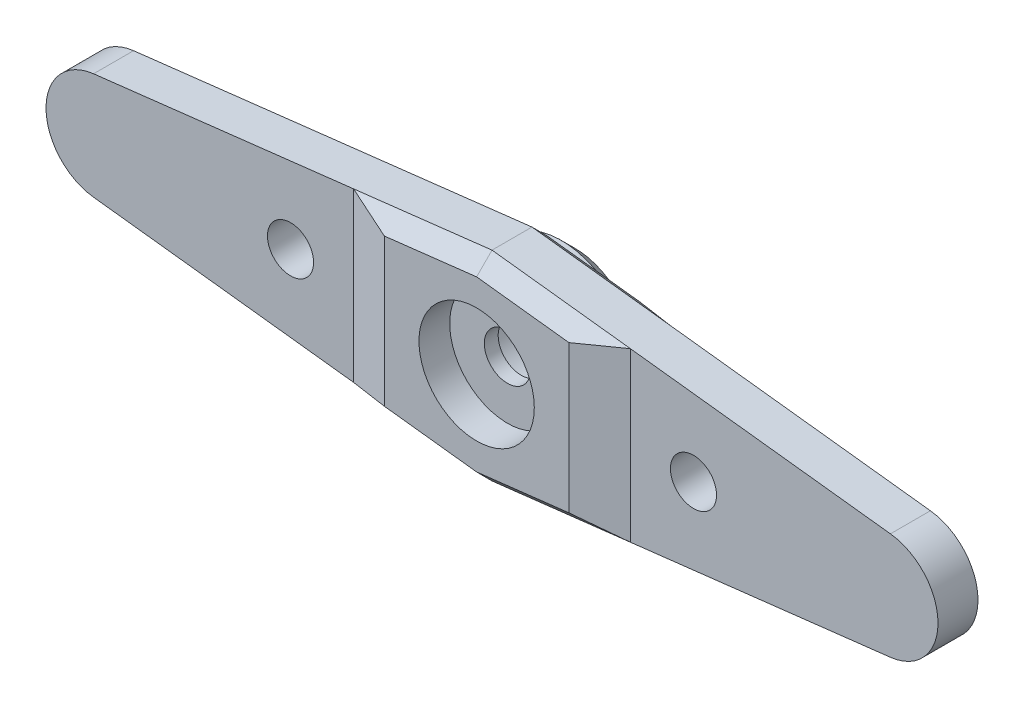
ISO-10303-21;
HEADER;
FILE_DESCRIPTION(('STEP AP214'),'2;1');
FILE_NAME('part.step','',(''),(''),'','','');
FILE_SCHEMA(('AUTOMOTIVE_DESIGN { 1 0 10303 214 1 1 1 1 }'));
ENDSEC;
DATA;
#1=APPLICATION_CONTEXT('core data for automotive mechanical design processes');
#2=APPLICATION_PROTOCOL_DEFINITION('international standard','automotive_design',2000,#1);
#3=PRODUCT_CONTEXT('',#1,'mechanical');
#4=PRODUCT('Part','Part','',(#3));
#5=PRODUCT_RELATED_PRODUCT_CATEGORY('part','',(#4));
#6=PRODUCT_DEFINITION_FORMATION('','',#4);
#7=PRODUCT_DEFINITION_CONTEXT('part definition',#1,'design');
#8=PRODUCT_DEFINITION('design','',#6,#7);
#9=PRODUCT_DEFINITION_SHAPE('','',#8);
#10=(LENGTH_UNIT() NAMED_UNIT(*) SI_UNIT(.MILLI.,.METRE.));
#11=(NAMED_UNIT(*) PLANE_ANGLE_UNIT() SI_UNIT($,.RADIAN.));
#12=(NAMED_UNIT(*) SI_UNIT($,.STERADIAN.) SOLID_ANGLE_UNIT());
#13=UNCERTAINTY_MEASURE_WITH_UNIT(LENGTH_MEASURE(1.E-05),#10,'distance_accuracy_value','');
#14=(GEOMETRIC_REPRESENTATION_CONTEXT(3) GLOBAL_UNCERTAINTY_ASSIGNED_CONTEXT((#13)) GLOBAL_UNIT_ASSIGNED_CONTEXT((#10,
#11,#12)) REPRESENTATION_CONTEXT('',''));
#15=CARTESIAN_POINT('',(0.,0.,0.));
#16=DIRECTION('',(0.,0.,1.));
#17=DIRECTION('',(1.,0.,0.));
#18=AXIS2_PLACEMENT_3D('',#15,#16,#17);
#19=CARTESIAN_POINT('',(0.,0.,-1.));
#20=DIRECTION('',(0.,0.,1.));
#21=DIRECTION('',(1.,0.,0.));
#22=AXIS2_PLACEMENT_3D('',#19,#20,#21);
#23=CYLINDRICAL_SURFACE('',#22,1.5);
#24=CARTESIAN_POINT('',(0.,0.,1.6));
#25=DIRECTION('',(0.,0.,1.));
#26=DIRECTION('',(1.,0.,0.));
#27=AXIS2_PLACEMENT_3D('',#24,#25,#26);
#28=CIRCLE('',#27,1.5);
#29=CARTESIAN_POINT('',(1.5,0.,1.6));
#30=VERTEX_POINT('',#29);
#31=EDGE_CURVE('E183',#30,#30,#28,.F.);
#32=ORIENTED_EDGE('',*,*,#31,.F.);
#33=EDGE_LOOP('',(#32));
#34=FACE_BOUND('',#33,.T.);
#35=CARTESIAN_POINT('',(0.,0.,0.699999999999999));
#36=DIRECTION('',(0.,0.,-1.));
#37=DIRECTION('',(-1.,0.,0.));
#38=AXIS2_PLACEMENT_3D('',#35,#36,#37);
#39=CIRCLE('',#38,1.5);
#40=CARTESIAN_POINT('',(-1.5,0.,0.699999999999999));
#41=VERTEX_POINT('',#40);
#42=EDGE_CURVE('E36',#41,#41,#39,.F.);
#43=ORIENTED_EDGE('',*,*,#42,.F.);
#44=EDGE_LOOP('',(#43));
#45=FACE_BOUND('',#44,.T.);
#46=ADVANCED_FACE('F32',(#34,#45),#23,.F.);
#47=CARTESIAN_POINT('',(25.5,0.,0.));
#48=DIRECTION('',(0.,0.,-1.));
#49=DIRECTION('',(-1.,0.,0.));
#50=AXIS2_PLACEMENT_3D('',#47,#48,#49);
#51=PLANE('',#50);
#52=DIRECTION('',(0.,1.,0.));
#53=VECTOR('',#52,1.);
#54=CARTESIAN_POINT('',(-9.,5.4495618893604,0.));
#55=LINE('',#54,#53);
#56=CARTESIAN_POINT('',(-9.,-5.4495618893604,0.));
#57=VERTEX_POINT('',#56);
#58=CARTESIAN_POINT('',(-9.,5.4495618893604,0.));
#59=VERTEX_POINT('',#58);
#60=EDGE_CURVE('E182',#57,#59,#55,.T.);
#61=ORIENTED_EDGE('',*,*,#60,.F.);
#62=DIRECTION('',(0.993257572769666,-0.115928400902071,0.));
#63=VECTOR('',#62,1.);
#64=CARTESIAN_POINT('',(0.,-6.5,0.));
#65=LINE('',#64,#63);
#66=CARTESIAN_POINT('',(-25.9057494031572,-3.47640150469385,0.));
#67=VERTEX_POINT('',#66);
#68=EDGE_CURVE('E178',#67,#57,#65,.T.);
#69=ORIENTED_EDGE('',*,*,#68,.F.);
#70=CARTESIAN_POINT('',(-25.5,0.,0.));
#71=DIRECTION('',(0.,0.,1.));
#72=DIRECTION('',(-1.,0.,0.));
#73=AXIS2_PLACEMENT_3D('',#70,#71,#72);
#74=CIRCLE('',#73,3.50000000000002);
#75=CARTESIAN_POINT('',(-25.9057494031572,3.47640150469384,0.));
#76=VERTEX_POINT('',#75);
#77=EDGE_CURVE('E232',#76,#67,#74,.T.);
#78=ORIENTED_EDGE('',*,*,#77,.F.);
#79=DIRECTION('',(-0.993257572769666,-0.115928400902071,0.));
#80=VECTOR('',#79,1.);
#81=CARTESIAN_POINT('',(-25.9057494031572,3.47640150469384,0.));
#82=LINE('',#81,#80);
#83=EDGE_CURVE('E206',#59,#76,#82,.T.);
#84=ORIENTED_EDGE('',*,*,#83,.F.);
#85=EDGE_LOOP('',(#61,#69,#78,#84));
#86=FACE_BOUND('',#85,.T.);
#87=CARTESIAN_POINT('',(-13.1,0.,0.));
#88=DIRECTION('',(0.,0.,1.));
#89=DIRECTION('',(1.,0.,0.));
#90=AXIS2_PLACEMENT_3D('',#87,#88,#89);
#91=CIRCLE('',#90,1.5);
#92=CARTESIAN_POINT('',(-11.6,0.,0.));
#93=VERTEX_POINT('',#92);
#94=EDGE_CURVE('E210',#93,#93,#91,.T.);
#95=ORIENTED_EDGE('',*,*,#94,.T.);
#96=EDGE_LOOP('',(#95));
#97=FACE_BOUND('',#96,.T.);
#98=ADVANCED_FACE('F380',(#86,#97),#51,.T.);
#99=CARTESIAN_POINT('',(25.5,0.,2.6));
#100=DIRECTION('',(0.,0.,-1.));
#101=DIRECTION('',(-1.,0.,0.));
#102=AXIS2_PLACEMENT_3D('',#99,#100,#101);
#103=PLANE('',#102);
#104=CARTESIAN_POINT('',(13.1,0.,2.6));
#105=DIRECTION('',(0.,0.,1.));
#106=DIRECTION('',(1.,0.,0.));
#107=AXIS2_PLACEMENT_3D('',#104,#105,#106);
#108=CIRCLE('',#107,1.5);
#109=CARTESIAN_POINT('',(14.6,0.,2.6));
#110=VERTEX_POINT('',#109);
#111=EDGE_CURVE('E207',#110,#110,#108,.T.);
#112=ORIENTED_EDGE('',*,*,#111,.F.);
#113=EDGE_LOOP('',(#112));
#114=FACE_BOUND('',#113,.T.);
#115=DIRECTION('',(0.,1.,0.));
#116=VECTOR('',#115,1.);
#117=CARTESIAN_POINT('',(9.,-5.4495618893604,2.6));
#118=LINE('',#117,#116);
#119=CARTESIAN_POINT('',(9.,-5.4495618893604,2.6));
#120=VERTEX_POINT('',#119);
#121=CARTESIAN_POINT('',(9.,5.4495618893604,2.6));
#122=VERTEX_POINT('',#121);
#123=EDGE_CURVE('E198',#120,#122,#118,.T.);
#124=ORIENTED_EDGE('',*,*,#123,.F.);
#125=DIRECTION('',(0.993257572769666,0.115928400902072,0.));
#126=VECTOR('',#125,1.);
#127=CARTESIAN_POINT('',(25.9057494031572,-3.47640150469383,2.6));
#128=LINE('',#127,#126);
#129=CARTESIAN_POINT('',(25.9057494031573,-3.47640150469383,2.6));
#130=VERTEX_POINT('',#129);
#131=EDGE_CURVE('E223',#120,#130,#128,.T.);
#132=ORIENTED_EDGE('',*,*,#131,.T.);
#133=CARTESIAN_POINT('',(25.5,0.,2.6));
#134=DIRECTION('',(0.,0.,1.));
#135=DIRECTION('',(-1.,0.,0.));
#136=AXIS2_PLACEMENT_3D('',#133,#134,#135);
#137=CIRCLE('',#136,3.5);
#138=CARTESIAN_POINT('',(25.9057494031572,3.47640150469383,2.6));
#139=VERTEX_POINT('',#138);
#140=EDGE_CURVE('E225',#130,#139,#137,.T.);
#141=ORIENTED_EDGE('',*,*,#140,.T.);
#142=DIRECTION('',(-0.993257572769666,0.115928400902072,0.));
#143=VECTOR('',#142,1.);
#144=CARTESIAN_POINT('',(0.,6.5,2.6));
#145=LINE('',#144,#143);
#146=EDGE_CURVE('E227',#139,#122,#145,.T.);
#147=ORIENTED_EDGE('',*,*,#146,.T.);
#148=EDGE_LOOP('',(#124,#132,#141,#147));
#149=FACE_BOUND('',#148,.T.);
#150=ADVANCED_FACE('F359',(#114,#149),#103,.F.);
#151=CARTESIAN_POINT('',(-13.1,0.,2.6));
#152=DIRECTION('',(0.,0.,1.));
#153=DIRECTION('',(1.,0.,0.));
#154=AXIS2_PLACEMENT_3D('',#151,#152,#153);
#155=CIRCLE('',#154,1.5);
#156=CARTESIAN_POINT('',(-11.6,0.,2.6));
#157=VERTEX_POINT('',#156);
#158=EDGE_CURVE('E202',#157,#157,#155,.T.);
#159=ORIENTED_EDGE('',*,*,#158,.F.);
#160=EDGE_LOOP('',(#159));
#161=FACE_BOUND('',#160,.T.);
#162=DIRECTION('',(0.,-1.,0.));
#163=VECTOR('',#162,1.);
#164=CARTESIAN_POINT('',(-9.,5.4495618893604,2.6));
#165=LINE('',#164,#163);
#166=CARTESIAN_POINT('',(-9.,5.4495618893604,2.6));
#167=VERTEX_POINT('',#166);
#168=CARTESIAN_POINT('',(-9.,-5.44956188936041,2.6));
#169=VERTEX_POINT('',#168);
#170=EDGE_CURVE('E195',#167,#169,#165,.T.);
#171=ORIENTED_EDGE('',*,*,#170,.F.);
#172=DIRECTION('',(-0.993257572769666,-0.115928400902071,0.));
#173=VECTOR('',#172,1.);
#174=CARTESIAN_POINT('',(-25.9057494031572,3.47640150469384,2.6));
#175=LINE('',#174,#173);
#176=CARTESIAN_POINT('',(-25.9057494031572,3.47640150469384,2.6));
#177=VERTEX_POINT('',#176);
#178=EDGE_CURVE('E215',#167,#177,#175,.T.);
#179=ORIENTED_EDGE('',*,*,#178,.T.);
#180=CARTESIAN_POINT('',(-25.5,0.,2.6));
#181=DIRECTION('',(0.,0.,1.));
#182=DIRECTION('',(-1.,0.,0.));
#183=AXIS2_PLACEMENT_3D('',#180,#181,#182);
#184=CIRCLE('',#183,3.50000000000002);
#185=CARTESIAN_POINT('',(-25.9057494031572,-3.47640150469385,2.6));
#186=VERTEX_POINT('',#185);
#187=EDGE_CURVE('E217',#177,#186,#184,.T.);
#188=ORIENTED_EDGE('',*,*,#187,.T.);
#189=DIRECTION('',(0.993257572769666,-0.115928400902071,0.));
#190=VECTOR('',#189,1.);
#191=CARTESIAN_POINT('',(0.,-6.5,2.6));
#192=LINE('',#191,#190);
#193=EDGE_CURVE('E220',#186,#169,#192,.T.);
#194=ORIENTED_EDGE('',*,*,#193,.T.);
#195=EDGE_LOOP('',(#171,#179,#188,#194));
#196=FACE_BOUND('',#195,.T.);
#197=ADVANCED_FACE('F443',(#161,#196),#103,.F.);
#198=CARTESIAN_POINT('',(-25.9057494031572,3.47640150469384,2.6));
#199=DIRECTION('',(0.115928400902071,-0.993257572769666,0.));
#200=DIRECTION('',(0.993257572769666,0.115928400902071,0.));
#201=AXIS2_PLACEMENT_3D('',#198,#199,#200);
#202=PLANE('',#201);
#203=DIRECTION('',(0.,0.,-1.));
#204=VECTOR('',#203,1.);
#205=CARTESIAN_POINT('',(0.,6.5,2.6));
#206=LINE('',#205,#204);
#207=CARTESIAN_POINT('',(0.,6.5,2.59999999999999));
#208=VERTEX_POINT('',#207);
#209=CARTESIAN_POINT('',(0.,6.5,0.));
#210=VERTEX_POINT('',#209);
#211=EDGE_CURVE('E230',#208,#210,#206,.T.);
#212=ORIENTED_EDGE('',*,*,#211,.T.);
#213=DIRECTION('',(-0.993257572769666,-0.115928400902071,0.));
#214=VECTOR('',#213,1.);
#215=CARTESIAN_POINT('',(-25.9057494031572,3.47640150469384,0.));
#216=LINE('',#215,#214);
#217=EDGE_CURVE('E298',#210,#59,#216,.T.);
#218=ORIENTED_EDGE('',*,*,#217,.T.);
#219=ORIENTED_EDGE('',*,*,#83,.T.);
#220=DIRECTION('',(0.,0.,-1.));
#221=VECTOR('',#220,1.);
#222=CARTESIAN_POINT('',(-25.9057494031572,3.47640150469384,2.6));
#223=LINE('',#222,#221);
#224=EDGE_CURVE('E249',#177,#76,#223,.T.);
#225=ORIENTED_EDGE('',*,*,#224,.F.);
#226=ORIENTED_EDGE('',*,*,#178,.F.);
#227=DIRECTION('',(0.993257572769666,0.115928400902071,0.));
#228=VECTOR('',#227,1.);
#229=CARTESIAN_POINT('',(0.,6.5,2.59999999999999));
#230=LINE('',#229,#228);
#231=EDGE_CURVE('E267',#167,#208,#230,.T.);
#232=ORIENTED_EDGE('',*,*,#231,.T.);
#233=EDGE_LOOP('',(#212,#218,#219,#225,#226,#232));
#234=FACE_BOUND('',#233,.T.);
#235=ADVANCED_FACE('F376',(#234),#202,.F.);
#236=CARTESIAN_POINT('',(-25.5,0.,2.6));
#237=DIRECTION('',(0.,0.,-1.));
#238=DIRECTION('',(-1.,0.,0.));
#239=AXIS2_PLACEMENT_3D('',#236,#237,#238);
#240=CYLINDRICAL_SURFACE('',#239,3.50000000000002);
#241=ORIENTED_EDGE('',*,*,#77,.T.);
#242=DIRECTION('',(0.,0.,-1.));
#243=VECTOR('',#242,1.);
#244=CARTESIAN_POINT('',(-25.9057494031572,-3.47640150469385,2.6));
#245=LINE('',#244,#243);
#246=EDGE_CURVE('E246',#186,#67,#245,.T.);
#247=ORIENTED_EDGE('',*,*,#246,.F.);
#248=ORIENTED_EDGE('',*,*,#187,.F.);
#249=ORIENTED_EDGE('',*,*,#224,.T.);
#250=EDGE_LOOP('',(#241,#247,#248,#249));
#251=FACE_BOUND('',#250,.T.);
#252=ADVANCED_FACE('F396',(#251),#240,.T.);
#253=CARTESIAN_POINT('',(0.,-6.5,2.6));
#254=DIRECTION('',(0.115928400902071,0.993257572769666,0.));
#255=DIRECTION('',(-0.993257572769666,0.115928400902071,0.));
#256=AXIS2_PLACEMENT_3D('',#253,#254,#255);
#257=PLANE('',#256);
#258=ORIENTED_EDGE('',*,*,#68,.T.);
#259=DIRECTION('',(0.993257572769666,-0.115928400902071,0.));
#260=VECTOR('',#259,1.);
#261=CARTESIAN_POINT('',(0.,-6.5,0.));
#262=LINE('',#261,#260);
#263=CARTESIAN_POINT('',(0.,-6.5,0.));
#264=VERTEX_POINT('',#263);
#265=EDGE_CURVE('E167',#57,#264,#262,.T.);
#266=ORIENTED_EDGE('',*,*,#265,.T.);
#267=DIRECTION('',(0.,0.,-1.));
#268=VECTOR('',#267,1.);
#269=CARTESIAN_POINT('',(0.,-6.5,2.6));
#270=LINE('',#269,#268);
#271=CARTESIAN_POINT('',(0.,-6.5,2.6));
#272=VERTEX_POINT('',#271);
#273=EDGE_CURVE('E166',#272,#264,#270,.T.);
#274=ORIENTED_EDGE('',*,*,#273,.F.);
#275=DIRECTION('',(-0.993257572769666,0.115928400902071,0.));
#276=VECTOR('',#275,1.);
#277=CARTESIAN_POINT('',(-9.,-5.4495618893604,2.6));
#278=LINE('',#277,#276);
#279=EDGE_CURVE('E264',#272,#169,#278,.T.);
#280=ORIENTED_EDGE('',*,*,#279,.T.);
#281=ORIENTED_EDGE('',*,*,#193,.F.);
#282=ORIENTED_EDGE('',*,*,#246,.T.);
#283=EDGE_LOOP('',(#258,#266,#274,#280,#281,#282));
#284=FACE_BOUND('',#283,.T.);
#285=ADVANCED_FACE('F390',(#284),#257,.F.);
#286=CARTESIAN_POINT('',(25.9057494031572,-3.47640150469383,2.6));
#287=DIRECTION('',(-0.115928400902072,0.993257572769666,0.));
#288=DIRECTION('',(-0.993257572769666,-0.115928400902072,0.));
#289=AXIS2_PLACEMENT_3D('',#286,#287,#288);
#290=PLANE('',#289);
#291=ORIENTED_EDGE('',*,*,#273,.T.);
#292=DIRECTION('',(0.993257572769666,0.115928400902072,0.));
#293=VECTOR('',#292,1.);
#294=CARTESIAN_POINT('',(25.9057494031572,-3.47640150469383,0.));
#295=LINE('',#294,#293);
#296=CARTESIAN_POINT('',(9.,-5.4495618893604,0.));
#297=VERTEX_POINT('',#296);
#298=EDGE_CURVE('E152',#264,#297,#295,.T.);
#299=ORIENTED_EDGE('',*,*,#298,.T.);
#300=DIRECTION('',(0.993257572769666,0.115928400902072,0.));
#301=VECTOR('',#300,1.);
#302=CARTESIAN_POINT('',(25.9057494031572,-3.47640150469383,0.));
#303=LINE('',#302,#301);
#304=CARTESIAN_POINT('',(25.9057494031573,-3.47640150469383,0.));
#305=VERTEX_POINT('',#304);
#306=EDGE_CURVE('E163',#297,#305,#303,.T.);
#307=ORIENTED_EDGE('',*,*,#306,.T.);
#308=DIRECTION('',(0.,0.,-1.));
#309=VECTOR('',#308,1.);
#310=CARTESIAN_POINT('',(25.9057494031573,-3.47640150469383,2.6));
#311=LINE('',#310,#309);
#312=EDGE_CURVE('E243',#130,#305,#311,.T.);
#313=ORIENTED_EDGE('',*,*,#312,.F.);
#314=ORIENTED_EDGE('',*,*,#131,.F.);
#315=DIRECTION('',(-0.993257572769666,-0.115928400902072,0.));
#316=VECTOR('',#315,1.);
#317=CARTESIAN_POINT('',(0.,-6.5,2.6));
#318=LINE('',#317,#316);
#319=EDGE_CURVE('E262',#120,#272,#318,.T.);
#320=ORIENTED_EDGE('',*,*,#319,.T.);
#321=EDGE_LOOP('',(#291,#299,#307,#313,#314,#320));
#322=FACE_BOUND('',#321,.T.);
#323=ADVANCED_FACE('F161',(#322),#290,.F.);
#324=CARTESIAN_POINT('',(25.5,0.,2.6));
#325=DIRECTION('',(0.,0.,-1.));
#326=DIRECTION('',(-1.,0.,0.));
#327=AXIS2_PLACEMENT_3D('',#324,#325,#326);
#328=CYLINDRICAL_SURFACE('',#327,3.5);
#329=CARTESIAN_POINT('',(25.5,0.,0.));
#330=DIRECTION('',(0.,0.,1.));
#331=DIRECTION('',(-1.,0.,0.));
#332=AXIS2_PLACEMENT_3D('',#329,#330,#331);
#333=CIRCLE('',#332,3.5);
#334=CARTESIAN_POINT('',(25.9057494031572,3.47640150469383,0.));
#335=VERTEX_POINT('',#334);
#336=EDGE_CURVE('E177',#305,#335,#333,.T.);
#337=ORIENTED_EDGE('',*,*,#336,.T.);
#338=DIRECTION('',(0.,0.,-1.));
#339=VECTOR('',#338,1.);
#340=CARTESIAN_POINT('',(25.9057494031572,3.47640150469383,2.6));
#341=LINE('',#340,#339);
#342=EDGE_CURVE('E240',#139,#335,#341,.T.);
#343=ORIENTED_EDGE('',*,*,#342,.F.);
#344=ORIENTED_EDGE('',*,*,#140,.F.);
#345=ORIENTED_EDGE('',*,*,#312,.T.);
#346=EDGE_LOOP('',(#337,#343,#344,#345));
#347=FACE_BOUND('',#346,.T.);
#348=ADVANCED_FACE('F364',(#347),#328,.T.);
#349=CARTESIAN_POINT('',(0.,6.5,2.6));
#350=DIRECTION('',(-0.115928400902072,-0.993257572769666,0.));
#351=DIRECTION('',(0.993257572769666,-0.115928400902072,0.));
#352=AXIS2_PLACEMENT_3D('',#349,#350,#351);
#353=PLANE('',#352);
#354=DIRECTION('',(-0.993257572769666,0.115928400902072,0.));
#355=VECTOR('',#354,1.);
#356=CARTESIAN_POINT('',(0.,6.5,0.));
#357=LINE('',#356,#355);
#358=CARTESIAN_POINT('',(9.,5.4495618893604,0.));
#359=VERTEX_POINT('',#358);
#360=EDGE_CURVE('E218',#335,#359,#357,.T.);
#361=ORIENTED_EDGE('',*,*,#360,.T.);
#362=DIRECTION('',(-0.993257572769666,0.115928400902072,0.));
#363=VECTOR('',#362,1.);
#364=CARTESIAN_POINT('',(0.,6.5,0.));
#365=LINE('',#364,#363);
#366=EDGE_CURVE('E168',#359,#210,#365,.T.);
#367=ORIENTED_EDGE('',*,*,#366,.T.);
#368=ORIENTED_EDGE('',*,*,#211,.F.);
#369=DIRECTION('',(0.993257572769666,-0.115928400902072,0.));
#370=VECTOR('',#369,1.);
#371=CARTESIAN_POINT('',(9.,5.4495618893604,2.59999999999999));
#372=LINE('',#371,#370);
#373=EDGE_CURVE('E269',#208,#122,#372,.T.);
#374=ORIENTED_EDGE('',*,*,#373,.T.);
#375=ORIENTED_EDGE('',*,*,#146,.F.);
#376=ORIENTED_EDGE('',*,*,#342,.T.);
#377=EDGE_LOOP('',(#361,#367,#368,#374,#375,#376));
#378=FACE_BOUND('',#377,.T.);
#379=ADVANCED_FACE('F357',(#378),#353,.F.);
#380=DIRECTION('',(0.,-1.,0.));
#381=VECTOR('',#380,1.);
#382=CARTESIAN_POINT('',(9.,-5.4495618893604,0.));
#383=LINE('',#382,#381);
#384=EDGE_CURVE('E175',#359,#297,#383,.T.);
#385=ORIENTED_EDGE('',*,*,#384,.F.);
#386=ORIENTED_EDGE('',*,*,#360,.F.);
#387=ORIENTED_EDGE('',*,*,#336,.F.);
#388=ORIENTED_EDGE('',*,*,#306,.F.);
#389=EDGE_LOOP('',(#385,#386,#387,#388));
#390=FACE_BOUND('',#389,.T.);
#391=CARTESIAN_POINT('',(13.1,0.,0.));
#392=DIRECTION('',(0.,0.,1.));
#393=DIRECTION('',(1.,0.,0.));
#394=AXIS2_PLACEMENT_3D('',#391,#392,#393);
#395=CIRCLE('',#394,1.5);
#396=CARTESIAN_POINT('',(14.6,0.,0.));
#397=VERTEX_POINT('',#396);
#398=EDGE_CURVE('E203',#397,#397,#395,.T.);
#399=ORIENTED_EDGE('',*,*,#398,.T.);
#400=EDGE_LOOP('',(#399));
#401=FACE_BOUND('',#400,.T.);
#402=ADVANCED_FACE('F172',(#390,#401),#51,.T.);
#403=CARTESIAN_POINT('',(-13.1,0.,0.));
#404=DIRECTION('',(0.,0.,1.));
#405=DIRECTION('',(1.,0.,0.));
#406=AXIS2_PLACEMENT_3D('',#403,#404,#405);
#407=CYLINDRICAL_SURFACE('',#406,1.5);
#408=ORIENTED_EDGE('',*,*,#94,.F.);
#409=EDGE_LOOP('',(#408));
#410=FACE_BOUND('',#409,.T.);
#411=ORIENTED_EDGE('',*,*,#158,.T.);
#412=EDGE_LOOP('',(#411));
#413=FACE_BOUND('',#412,.T.);
#414=ADVANCED_FACE('F437',(#410,#413),#407,.F.);
#415=CARTESIAN_POINT('',(13.1,0.,0.));
#416=DIRECTION('',(0.,0.,1.));
#417=DIRECTION('',(1.,0.,0.));
#418=AXIS2_PLACEMENT_3D('',#415,#416,#417);
#419=CYLINDRICAL_SURFACE('',#418,1.5);
#420=ORIENTED_EDGE('',*,*,#398,.F.);
#421=EDGE_LOOP('',(#420));
#422=FACE_BOUND('',#421,.T.);
#423=ORIENTED_EDGE('',*,*,#111,.T.);
#424=EDGE_LOOP('',(#423));
#425=FACE_BOUND('',#424,.T.);
#426=ADVANCED_FACE('F339',(#422,#425),#419,.F.);
#427=CARTESIAN_POINT('',(0.,0.,3.6));
#428=DIRECTION('',(0.,0.,1.));
#429=DIRECTION('',(1.,0.,0.));
#430=AXIS2_PLACEMENT_3D('',#427,#428,#429);
#431=PLANE('',#430);
#432=CARTESIAN_POINT('',(0.,0.,3.6));
#433=DIRECTION('',(0.,0.,1.));
#434=DIRECTION('',(1.,0.,0.));
#435=AXIS2_PLACEMENT_3D('',#432,#433,#434);
#436=CIRCLE('',#435,3.75);
#437=CARTESIAN_POINT('',(3.75,0.,3.6));
#438=VERTEX_POINT('',#437);
#439=EDGE_CURVE('E192',#438,#438,#436,.T.);
#440=ORIENTED_EDGE('',*,*,#439,.F.);
#441=EDGE_LOOP('',(#440));
#442=FACE_BOUND('',#441,.T.);
#443=DIRECTION('',(0.993257572769666,0.115928400902072,0.));
#444=VECTOR('',#443,1.);
#445=CARTESIAN_POINT('',(8.88407159909793,-4.45630431659073,3.6));
#446=LINE('',#445,#444);
#447=CARTESIAN_POINT('',(0.,-5.49321180385111,3.6));
#448=VERTEX_POINT('',#447);
#449=CARTESIAN_POINT('',(5.99999999999998,-4.79291973009138,3.6));
#450=VERTEX_POINT('',#449);
#451=EDGE_CURVE('E259',#448,#450,#446,.T.);
#452=ORIENTED_EDGE('',*,*,#451,.T.);
#453=DIRECTION('',(0.,1.,0.));
#454=VECTOR('',#453,1.);
#455=CARTESIAN_POINT('',(5.99999999999998,4.4427736932115,3.6));
#456=LINE('',#455,#454);
#457=CARTESIAN_POINT('',(5.99999999999998,4.79291973009137,3.6));
#458=VERTEX_POINT('',#457);
#459=EDGE_CURVE('E279',#450,#458,#456,.T.);
#460=ORIENTED_EDGE('',*,*,#459,.T.);
#461=DIRECTION('',(-0.993257572769666,0.115928400902072,0.));
#462=VECTOR('',#461,1.);
#463=CARTESIAN_POINT('',(-0.115928400902071,5.50674242723033,3.6));
#464=LINE('',#463,#462);
#465=CARTESIAN_POINT('',(0.,5.4932118038511,3.6));
#466=VERTEX_POINT('',#465);
#467=EDGE_CURVE('E252',#458,#466,#464,.T.);
#468=ORIENTED_EDGE('',*,*,#467,.T.);
#469=DIRECTION('',(-0.993257572769666,-0.115928400902071,0.));
#470=VECTOR('',#469,1.);
#471=CARTESIAN_POINT('',(-8.88407159909793,4.45630431659073,3.6));
#472=LINE('',#471,#470);
#473=CARTESIAN_POINT('',(-5.99999999999998,4.79291973009137,3.6));
#474=VERTEX_POINT('',#473);
#475=EDGE_CURVE('E254',#466,#474,#472,.T.);
#476=ORIENTED_EDGE('',*,*,#475,.T.);
#477=DIRECTION('',(0.,-1.,0.));
#478=VECTOR('',#477,1.);
#479=CARTESIAN_POINT('',(-5.99999999999998,-4.44277369321152,3.6));
#480=LINE('',#479,#478);
#481=CARTESIAN_POINT('',(-5.99999999999998,-4.79291973009138,3.6));
#482=VERTEX_POINT('',#481);
#483=EDGE_CURVE('E272',#474,#482,#480,.T.);
#484=ORIENTED_EDGE('',*,*,#483,.T.);
#485=DIRECTION('',(0.993257572769666,-0.115928400902071,0.));
#486=VECTOR('',#485,1.);
#487=CARTESIAN_POINT('',(0.115928400902071,-5.50674242723034,3.6));
#488=LINE('',#487,#486);
#489=EDGE_CURVE('E257',#482,#448,#488,.T.);
#490=ORIENTED_EDGE('',*,*,#489,.T.);
#491=EDGE_LOOP('',(#452,#460,#468,#476,#484,#490));
#492=FACE_BOUND('',#491,.T.);
#493=ADVANCED_FACE('F335',(#442,#492),#431,.T.);
#494=CARTESIAN_POINT('',(-0.632525552715818,-5.41938636534821,3.6));
#495=DIRECTION('',(-0.0819737584099672,-0.702339165170323,0.707106781186546));
#496=DIRECTION('',(-0.993257572769666,0.115928400902071,0.));
#497=AXIS2_PLACEMENT_3D('',#494,#495,#496);
#498=PLANE('',#497);
#499=ORIENTED_EDGE('',*,*,#489,.F.);
#500=DIRECTION('',(-0.928869188776341,-0.203311556598852,-0.309623062925445));
#501=VECTOR('',#500,1.);
#502=CARTESIAN_POINT('',(-1.48726206785723,-3.80516840343224,5.10424597738091));
#503=LINE('',#502,#501);
#504=EDGE_CURVE('E286',#482,#169,#503,.T.);
#505=ORIENTED_EDGE('',*,*,#504,.T.);
#506=ORIENTED_EDGE('',*,*,#279,.F.);
#507=DIRECTION('',(0.,0.709494593662507,0.704710877994425));
#508=VECTOR('',#507,1.);
#509=CARTESIAN_POINT('',(0.,-5.45604936426333,3.63691187454316));
#510=LINE('',#509,#508);
#511=EDGE_CURVE('E199',#448,#272,#510,.F.);
#512=ORIENTED_EDGE('',*,*,#511,.F.);
#513=EDGE_LOOP('',(#499,#505,#506,#512));
#514=FACE_BOUND('',#513,.T.);
#515=ADVANCED_FACE('F338',(#514),#498,.T.);
#516=CARTESIAN_POINT('',(0.632525552715823,-5.41938636534821,3.6));
#517=DIRECTION('',(0.0819737584099679,-0.702339165170323,0.707106781186546));
#518=DIRECTION('',(-0.993257572769666,-0.115928400902072,0.));
#519=AXIS2_PLACEMENT_3D('',#516,#517,#518);
#520=PLANE('',#519);
#521=ORIENTED_EDGE('',*,*,#319,.F.);
#522=DIRECTION('',(-0.928869188776341,0.203311556598851,0.309623062925445));
#523=VECTOR('',#522,1.);
#524=CARTESIAN_POINT('',(1.48726206785723,-3.80516840343224,5.10424597738091));
#525=LINE('',#524,#523);
#526=EDGE_CURVE('E284',#120,#450,#525,.T.);
#527=ORIENTED_EDGE('',*,*,#526,.T.);
#528=ORIENTED_EDGE('',*,*,#451,.F.);
#529=ORIENTED_EDGE('',*,*,#511,.T.);
#530=EDGE_LOOP('',(#521,#527,#528,#529));
#531=FACE_BOUND('',#530,.T.);
#532=ADVANCED_FACE('F409',(#531),#520,.T.);
#533=CARTESIAN_POINT('',(0.632525552715822,5.41938636534821,3.6));
#534=DIRECTION('',(0.0819737584099679,0.702339165170323,0.707106781186546));
#535=DIRECTION('',(0.993257572769666,-0.115928400902072,0.));
#536=AXIS2_PLACEMENT_3D('',#533,#534,#535);
#537=PLANE('',#536);
#538=ORIENTED_EDGE('',*,*,#467,.F.);
#539=DIRECTION('',(0.928869188776341,0.203311556598851,-0.309623062925445));
#540=VECTOR('',#539,1.);
#541=CARTESIAN_POINT('',(1.48726206785723,3.80516840343224,5.10424597738091));
#542=LINE('',#541,#540);
#543=EDGE_CURVE('E282',#458,#122,#542,.T.);
#544=ORIENTED_EDGE('',*,*,#543,.T.);
#545=ORIENTED_EDGE('',*,*,#373,.F.);
#546=DIRECTION('',(0.,-0.709494593662507,0.704710877994426));
#547=VECTOR('',#546,1.);
#548=CARTESIAN_POINT('',(0.,5.45604936426332,3.63691187454316));
#549=LINE('',#548,#547);
#550=EDGE_CURVE('E186',#466,#208,#549,.F.);
#551=ORIENTED_EDGE('',*,*,#550,.F.);
#552=EDGE_LOOP('',(#538,#544,#545,#551));
#553=FACE_BOUND('',#552,.T.);
#554=ADVANCED_FACE('F352',(#553),#537,.T.);
#555=CARTESIAN_POINT('',(-0.632525552715819,5.41938636534821,3.6));
#556=DIRECTION('',(-0.0819737584099676,0.702339165170324,0.707106781186546));
#557=DIRECTION('',(0.993257572769666,0.115928400902071,0.));
#558=AXIS2_PLACEMENT_3D('',#555,#556,#557);
#559=PLANE('',#558);
#560=ORIENTED_EDGE('',*,*,#231,.F.);
#561=DIRECTION('',(0.928869188776341,-0.203311556598851,0.309623062925445));
#562=VECTOR('',#561,1.);
#563=CARTESIAN_POINT('',(-1.48726206785723,3.80516840343224,5.10424597738091));
#564=LINE('',#563,#562);
#565=EDGE_CURVE('E288',#167,#474,#564,.T.);
#566=ORIENTED_EDGE('',*,*,#565,.T.);
#567=ORIENTED_EDGE('',*,*,#475,.F.);
#568=ORIENTED_EDGE('',*,*,#550,.T.);
#569=EDGE_LOOP('',(#560,#566,#567,#568));
#570=FACE_BOUND('',#569,.T.);
#571=ADVANCED_FACE('F402',(#570),#559,.T.);
#572=CARTESIAN_POINT('',(5.99999999999998,0.,3.6));
#573=DIRECTION('',(0.316227766016836,0.,0.948683298050515));
#574=DIRECTION('',(0.,-1.,0.));
#575=AXIS2_PLACEMENT_3D('',#572,#573,#574);
#576=PLANE('',#575);
#577=ORIENTED_EDGE('',*,*,#526,.F.);
#578=ORIENTED_EDGE('',*,*,#123,.T.);
#579=ORIENTED_EDGE('',*,*,#543,.F.);
#580=ORIENTED_EDGE('',*,*,#459,.F.);
#581=EDGE_LOOP('',(#577,#578,#579,#580));
#582=FACE_BOUND('',#581,.T.);
#583=ADVANCED_FACE('F349',(#582),#576,.T.);
#584=CARTESIAN_POINT('',(-5.99999999999998,0.,3.6));
#585=DIRECTION('',(-0.316227766016836,0.,0.948683298050515));
#586=DIRECTION('',(0.,1.,0.));
#587=AXIS2_PLACEMENT_3D('',#584,#585,#586);
#588=PLANE('',#587);
#589=ORIENTED_EDGE('',*,*,#565,.F.);
#590=ORIENTED_EDGE('',*,*,#170,.T.);
#591=ORIENTED_EDGE('',*,*,#504,.F.);
#592=ORIENTED_EDGE('',*,*,#483,.F.);
#593=EDGE_LOOP('',(#589,#590,#591,#592));
#594=FACE_BOUND('',#593,.T.);
#595=ADVANCED_FACE('F406',(#594),#588,.T.);
#596=CARTESIAN_POINT('',(0.,0.,-1.));
#597=DIRECTION('',(0.,0.,1.));
#598=DIRECTION('',(1.,0.,0.));
#599=AXIS2_PLACEMENT_3D('',#596,#597,#598);
#600=PLANE('',#599);
#601=CARTESIAN_POINT('',(0.,0.,-1.));
#602=DIRECTION('',(0.,0.,-1.));
#603=DIRECTION('',(-1.,0.,0.));
#604=AXIS2_PLACEMENT_3D('',#601,#602,#603);
#605=CIRCLE('',#604,4.8);
#606=CARTESIAN_POINT('',(-4.8,0.,-1.));
#607=VERTEX_POINT('',#606);
#608=EDGE_CURVE('E316',#607,#607,#605,.T.);
#609=ORIENTED_EDGE('',*,*,#608,.F.);
#610=EDGE_LOOP('',(#609));
#611=FACE_BOUND('',#610,.T.);
#612=DIRECTION('',(0.993257572769666,-0.115928400902072,0.));
#613=VECTOR('',#612,1.);
#614=CARTESIAN_POINT('',(0.632525552715822,5.4193863653482,-1.));
#615=LINE('',#614,#613);
#616=CARTESIAN_POINT('',(0.,5.4932118038511,-1.));
#617=VERTEX_POINT('',#616);
#618=CARTESIAN_POINT('',(5.99999999999997,4.79291973009137,-1.));
#619=VERTEX_POINT('',#618);
#620=EDGE_CURVE('E293',#617,#619,#615,.T.);
#621=ORIENTED_EDGE('',*,*,#620,.T.);
#622=DIRECTION('',(0.,-1.,0.));
#623=VECTOR('',#622,1.);
#624=CARTESIAN_POINT('',(5.99999999999997,0.,-1.));
#625=LINE('',#624,#623);
#626=CARTESIAN_POINT('',(5.99999999999997,-4.79291973009137,-1.));
#627=VERTEX_POINT('',#626);
#628=EDGE_CURVE('E156',#619,#627,#625,.T.);
#629=ORIENTED_EDGE('',*,*,#628,.T.);
#630=DIRECTION('',(-0.993257572769666,-0.115928400902072,0.));
#631=VECTOR('',#630,1.);
#632=CARTESIAN_POINT('',(0.632525552715822,-5.4193863653482,-1.));
#633=LINE('',#632,#631);
#634=CARTESIAN_POINT('',(0.,-5.4932118038511,-1.));
#635=VERTEX_POINT('',#634);
#636=EDGE_CURVE('E154',#627,#635,#633,.T.);
#637=ORIENTED_EDGE('',*,*,#636,.T.);
#638=DIRECTION('',(-0.993257572769666,0.115928400902071,0.));
#639=VECTOR('',#638,1.);
#640=CARTESIAN_POINT('',(-0.632525552715817,-5.41938636534821,-1.));
#641=LINE('',#640,#639);
#642=CARTESIAN_POINT('',(-5.99999999999996,-4.79291973009138,-1.));
#643=VERTEX_POINT('',#642);
#644=EDGE_CURVE('E289',#635,#643,#641,.T.);
#645=ORIENTED_EDGE('',*,*,#644,.T.);
#646=DIRECTION('',(0.,1.,0.));
#647=VECTOR('',#646,1.);
#648=CARTESIAN_POINT('',(-5.99999999999996,0.,-1.));
#649=LINE('',#648,#647);
#650=CARTESIAN_POINT('',(-5.99999999999996,4.79291973009138,-1.));
#651=VERTEX_POINT('',#650);
#652=EDGE_CURVE('E303',#643,#651,#649,.T.);
#653=ORIENTED_EDGE('',*,*,#652,.T.);
#654=DIRECTION('',(0.993257572769666,0.115928400902071,0.));
#655=VECTOR('',#654,1.);
#656=CARTESIAN_POINT('',(-0.632525552715819,5.41938636534821,-1.));
#657=LINE('',#656,#655);
#658=EDGE_CURVE('E296',#651,#617,#657,.T.);
#659=ORIENTED_EDGE('',*,*,#658,.T.);
#660=EDGE_LOOP('',(#621,#629,#637,#645,#653,#659));
#661=FACE_BOUND('',#660,.T.);
#662=ADVANCED_FACE('F387',(#611,#661),#600,.F.);
#663=CARTESIAN_POINT('',(0.,0.,1.6));
#664=DIRECTION('',(0.,0.,1.));
#665=DIRECTION('',(1.,0.,0.));
#666=AXIS2_PLACEMENT_3D('',#663,#664,#665);
#667=PLANE('',#666);
#668=CARTESIAN_POINT('',(0.,0.,1.6));
#669=DIRECTION('',(0.,0.,1.));
#670=DIRECTION('',(1.,0.,0.));
#671=AXIS2_PLACEMENT_3D('',#668,#669,#670);
#672=CIRCLE('',#671,3.75);
#673=CARTESIAN_POINT('',(3.75,0.,1.6));
#674=VERTEX_POINT('',#673);
#675=EDGE_CURVE('E189',#674,#674,#672,.T.);
#676=ORIENTED_EDGE('',*,*,#675,.T.);
#677=EDGE_LOOP('',(#676));
#678=FACE_BOUND('',#677,.T.);
#679=ORIENTED_EDGE('',*,*,#31,.T.);
#680=EDGE_LOOP('',(#679));
#681=FACE_BOUND('',#680,.T.);
#682=ADVANCED_FACE('F432',(#678,#681),#667,.T.);
#683=CARTESIAN_POINT('',(0.,0.,1.6));
#684=DIRECTION('',(0.,0.,1.));
#685=DIRECTION('',(1.,0.,0.));
#686=AXIS2_PLACEMENT_3D('',#683,#684,#685);
#687=CYLINDRICAL_SURFACE('',#686,3.75);
#688=ORIENTED_EDGE('',*,*,#675,.F.);
#689=EDGE_LOOP('',(#688));
#690=FACE_BOUND('',#689,.T.);
#691=ORIENTED_EDGE('',*,*,#439,.T.);
#692=EDGE_LOOP('',(#691));
#693=FACE_BOUND('',#692,.T.);
#694=ADVANCED_FACE('F333',(#690,#693),#687,.F.);
#695=CARTESIAN_POINT('',(0.632525552715822,5.41938636534821,-1.));
#696=DIRECTION('',(-0.0819737584099679,-0.702339165170323,0.707106781186546));
#697=DIRECTION('',(0.993257572769666,-0.115928400902072,0.));
#698=AXIS2_PLACEMENT_3D('',#695,#696,#697);
#699=PLANE('',#698);
#700=ORIENTED_EDGE('',*,*,#366,.F.);
#701=DIRECTION('',(-0.928869188776341,-0.203311556598851,-0.309623062925444));
#702=VECTOR('',#701,1.);
#703=CARTESIAN_POINT('',(1.48726206785722,3.80516840343224,-2.5042459773809));
#704=LINE('',#703,#702);
#705=EDGE_CURVE('E155',#359,#619,#704,.T.);
#706=ORIENTED_EDGE('',*,*,#705,.T.);
#707=ORIENTED_EDGE('',*,*,#620,.F.);
#708=DIRECTION('',(0.,0.709494593662507,0.704710877994425));
#709=VECTOR('',#708,1.);
#710=CARTESIAN_POINT('',(0.,5.45604936426332,-1.03691187454316));
#711=LINE('',#710,#709);
#712=EDGE_CURVE('E304',#210,#617,#711,.F.);
#713=ORIENTED_EDGE('',*,*,#712,.F.);
#714=EDGE_LOOP('',(#700,#706,#707,#713));
#715=FACE_BOUND('',#714,.T.);
#716=ADVANCED_FACE('F368',(#715),#699,.F.);
#717=CARTESIAN_POINT('',(-0.632525552715819,5.41938636534821,-1.));
#718=DIRECTION('',(0.0819737584099675,-0.702339165170323,0.707106781186546));
#719=DIRECTION('',(0.993257572769666,0.115928400902071,0.));
#720=AXIS2_PLACEMENT_3D('',#717,#718,#719);
#721=PLANE('',#720);
#722=ORIENTED_EDGE('',*,*,#658,.F.);
#723=DIRECTION('',(-0.928869188776341,0.203311556598852,0.309623062925445));
#724=VECTOR('',#723,1.);
#725=CARTESIAN_POINT('',(-1.48726206785722,3.80516840343224,-2.5042459773809));
#726=LINE('',#725,#724);
#727=EDGE_CURVE('E313',#651,#59,#726,.T.);
#728=ORIENTED_EDGE('',*,*,#727,.T.);
#729=ORIENTED_EDGE('',*,*,#217,.F.);
#730=ORIENTED_EDGE('',*,*,#712,.T.);
#731=EDGE_LOOP('',(#722,#728,#729,#730));
#732=FACE_BOUND('',#731,.T.);
#733=ADVANCED_FACE('F373',(#732),#721,.F.);
#734=CARTESIAN_POINT('',(-0.632525552715817,-5.41938636534821,-1.));
#735=DIRECTION('',(0.0819737584099669,0.702339165170321,0.707106781186549));
#736=DIRECTION('',(-0.993257572769666,0.115928400902071,0.));
#737=AXIS2_PLACEMENT_3D('',#734,#735,#736);
#738=PLANE('',#737);
#739=ORIENTED_EDGE('',*,*,#265,.F.);
#740=DIRECTION('',(0.928869188776341,0.203311556598854,-0.309623062925444));
#741=VECTOR('',#740,1.);
#742=CARTESIAN_POINT('',(-1.48726206785723,-3.80516840343223,-2.5042459773809));
#743=LINE('',#742,#741);
#744=EDGE_CURVE('E48',#57,#643,#743,.T.);
#745=ORIENTED_EDGE('',*,*,#744,.T.);
#746=ORIENTED_EDGE('',*,*,#644,.F.);
#747=DIRECTION('',(0.,-0.70949459366251,0.704710877994423));
#748=VECTOR('',#747,1.);
#749=CARTESIAN_POINT('',(0.,-5.45604936426332,-1.03691187454316));
#750=LINE('',#749,#748);
#751=EDGE_CURVE('E307',#264,#635,#750,.F.);
#752=ORIENTED_EDGE('',*,*,#751,.F.);
#753=EDGE_LOOP('',(#739,#745,#746,#752));
#754=FACE_BOUND('',#753,.T.);
#755=ADVANCED_FACE('F388',(#754),#738,.F.);
#756=CARTESIAN_POINT('',(0.632525552715822,-5.4193863653482,-1.));
#757=DIRECTION('',(-0.0819737584099676,0.70233916517032,0.707106781186549));
#758=DIRECTION('',(-0.993257572769666,-0.115928400902072,0.));
#759=AXIS2_PLACEMENT_3D('',#756,#757,#758);
#760=PLANE('',#759);
#761=ORIENTED_EDGE('',*,*,#636,.F.);
#762=DIRECTION('',(0.928869188776341,-0.203311556598853,0.309623062925444));
#763=VECTOR('',#762,1.);
#764=CARTESIAN_POINT('',(1.48726206785723,-3.80516840343223,-2.5042459773809));
#765=LINE('',#764,#763);
#766=EDGE_CURVE('E56',#627,#297,#765,.T.);
#767=ORIENTED_EDGE('',*,*,#766,.T.);
#768=ORIENTED_EDGE('',*,*,#298,.F.);
#769=ORIENTED_EDGE('',*,*,#751,.T.);
#770=EDGE_LOOP('',(#761,#767,#768,#769));
#771=FACE_BOUND('',#770,.T.);
#772=ADVANCED_FACE('F150',(#771),#760,.F.);
#773=CARTESIAN_POINT('',(5.99999999999997,0.,-1.));
#774=DIRECTION('',(-0.316227766016835,0.,0.948683298050515));
#775=DIRECTION('',(0.,-1.,0.));
#776=AXIS2_PLACEMENT_3D('',#773,#774,#775);
#777=PLANE('',#776);
#778=ORIENTED_EDGE('',*,*,#705,.F.);
#779=ORIENTED_EDGE('',*,*,#384,.T.);
#780=ORIENTED_EDGE('',*,*,#766,.F.);
#781=ORIENTED_EDGE('',*,*,#628,.F.);
#782=EDGE_LOOP('',(#778,#779,#780,#781));
#783=FACE_BOUND('',#782,.T.);
#784=ADVANCED_FACE('F181',(#783),#777,.F.);
#785=CARTESIAN_POINT('',(-5.99999999999996,0.,-1.));
#786=DIRECTION('',(0.316227766016836,0.,0.948683298050515));
#787=DIRECTION('',(0.,1.,0.));
#788=AXIS2_PLACEMENT_3D('',#785,#786,#787);
#789=PLANE('',#788);
#790=ORIENTED_EDGE('',*,*,#744,.F.);
#791=ORIENTED_EDGE('',*,*,#60,.T.);
#792=ORIENTED_EDGE('',*,*,#727,.F.);
#793=ORIENTED_EDGE('',*,*,#652,.F.);
#794=EDGE_LOOP('',(#790,#791,#792,#793));
#795=FACE_BOUND('',#794,.T.);
#796=ADVANCED_FACE('F384',(#795),#789,.F.);
#797=CARTESIAN_POINT('',(0.,0.,-2.8));
#798=DIRECTION('',(0.,0.,-1.));
#799=DIRECTION('',(-1.,0.,0.));
#800=AXIS2_PLACEMENT_3D('',#797,#798,#799);
#801=PLANE('',#800);
#802=CARTESIAN_POINT('',(0.,0.,-2.8));
#803=DIRECTION('',(0.,0.,-1.));
#804=DIRECTION('',(-1.,0.,0.));
#805=AXIS2_PLACEMENT_3D('',#802,#803,#804);
#806=CIRCLE('',#805,2.9);
#807=CARTESIAN_POINT('',(-2.9,0.,-2.8));
#808=VERTEX_POINT('',#807);
#809=EDGE_CURVE('E325',#808,#808,#806,.T.);
#810=ORIENTED_EDGE('',*,*,#809,.F.);
#811=EDGE_LOOP('',(#810));
#812=FACE_BOUND('',#811,.T.);
#813=CARTESIAN_POINT('',(0.,0.,-2.8));
#814=DIRECTION('',(0.,0.,-1.));
#815=DIRECTION('',(-1.,0.,0.));
#816=AXIS2_PLACEMENT_3D('',#813,#814,#815);
#817=CIRCLE('',#816,3.89999999999999);
#818=CARTESIAN_POINT('',(3.89999999999999,0.,-2.8));
#819=VERTEX_POINT('',#818);
#820=EDGE_CURVE('E41',#819,#819,#817,.T.);
#821=ORIENTED_EDGE('',*,*,#820,.T.);
#822=EDGE_LOOP('',(#821));
#823=FACE_BOUND('',#822,.T.);
#824=ADVANCED_FACE('F565',(#812,#823),#801,.T.);
#825=CARTESIAN_POINT('',(0.,0.,-2.8));
#826=DIRECTION('',(0.,0.,1.));
#827=DIRECTION('',(1.,0.,0.));
#828=AXIS2_PLACEMENT_3D('',#825,#826,#827);
#829=CYLINDRICAL_SURFACE('',#828,4.8);
#830=CARTESIAN_POINT('',(0.,0.,-1.9));
#831=DIRECTION('',(0.,0.,-1.));
#832=DIRECTION('',(-1.,0.,0.));
#833=AXIS2_PLACEMENT_3D('',#830,#831,#832);
#834=CIRCLE('',#833,4.8);
#835=CARTESIAN_POINT('',(4.8,0.,-1.9));
#836=VERTEX_POINT('',#835);
#837=EDGE_CURVE('E11',#836,#836,#834,.F.);
#838=ORIENTED_EDGE('',*,*,#837,.T.);
#839=EDGE_LOOP('',(#838));
#840=FACE_BOUND('',#839,.T.);
#841=ORIENTED_EDGE('',*,*,#608,.T.);
#842=EDGE_LOOP('',(#841));
#843=FACE_BOUND('',#842,.T.);
#844=ADVANCED_FACE('F579',(#840,#843),#829,.T.);
#845=CARTESIAN_POINT('',(0.,0.,-2.8));
#846=DIRECTION('',(0.,0.,1.));
#847=DIRECTION('',(1.,0.,0.));
#848=AXIS2_PLACEMENT_3D('',#845,#846,#847);
#849=CONICAL_SURFACE('',#848,3.89999999999999,0.785398163397448);
#850=CARTESIAN_POINT('',(4.8,0.,-1.9));
#851=CARTESIAN_POINT('',(4.790625,0.,-1.909375));
#852=CARTESIAN_POINT('',(4.78125,0.,-1.91875));
#853=CARTESIAN_POINT('',(4.7625,0.,-1.93749999999999));
#854=CARTESIAN_POINT('',(4.753125,0.,-1.946875));
#855=CARTESIAN_POINT('',(4.734375,0.,-1.965625));
#856=CARTESIAN_POINT('',(4.725,0.,-1.975));
#857=CARTESIAN_POINT('',(4.70625,0.,-1.99375));
#858=CARTESIAN_POINT('',(4.696875,0.,-2.003125));
#859=CARTESIAN_POINT('',(4.678125,0.,-2.021875));
#860=CARTESIAN_POINT('',(4.66875,0.,-2.03125));
#861=CARTESIAN_POINT('',(4.65,0.,-2.05));
#862=CARTESIAN_POINT('',(4.640625,0.,-2.059375));
#863=CARTESIAN_POINT('',(4.621875,0.,-2.078125));
#864=CARTESIAN_POINT('',(4.6125,0.,-2.0875));
#865=CARTESIAN_POINT('',(4.59375,0.,-2.10625));
#866=CARTESIAN_POINT('',(4.584375,0.,-2.115625));
#867=CARTESIAN_POINT('',(4.565625,0.,-2.134375));
#868=CARTESIAN_POINT('',(4.55625,0.,-2.14375));
#869=CARTESIAN_POINT('',(4.5375,0.,-2.1625));
#870=CARTESIAN_POINT('',(4.528125,0.,-2.171875));
#871=CARTESIAN_POINT('',(4.509375,0.,-2.190625));
#872=CARTESIAN_POINT('',(4.5,0.,-2.2));
#873=CARTESIAN_POINT('',(4.48125,0.,-2.21875));
#874=CARTESIAN_POINT('',(4.471875,0.,-2.228125));
#875=CARTESIAN_POINT('',(4.453125,0.,-2.246875));
#876=CARTESIAN_POINT('',(4.44375,0.,-2.25625));
#877=CARTESIAN_POINT('',(4.425,0.,-2.275));
#878=CARTESIAN_POINT('',(4.415625,0.,-2.284375));
#879=CARTESIAN_POINT('',(4.396875,0.,-2.303125));
#880=CARTESIAN_POINT('',(4.3875,0.,-2.3125));
#881=CARTESIAN_POINT('',(4.36875,0.,-2.33125));
#882=CARTESIAN_POINT('',(4.359375,0.,-2.340625));
#883=CARTESIAN_POINT('',(4.340625,0.,-2.359375));
#884=CARTESIAN_POINT('',(4.33125,0.,-2.36875));
#885=CARTESIAN_POINT('',(4.3125,0.,-2.3875));
#886=CARTESIAN_POINT('',(4.303125,0.,-2.396875));
#887=CARTESIAN_POINT('',(4.284375,0.,-2.415625));
#888=CARTESIAN_POINT('',(4.275,0.,-2.425));
#889=CARTESIAN_POINT('',(4.25625,0.,-2.44375));
#890=CARTESIAN_POINT('',(4.246875,0.,-2.453125));
#891=CARTESIAN_POINT('',(4.228125,0.,-2.471875));
#892=CARTESIAN_POINT('',(4.21875,0.,-2.48125));
#893=CARTESIAN_POINT('',(4.2,0.,-2.5));
#894=CARTESIAN_POINT('',(4.190625,0.,-2.509375));
#895=CARTESIAN_POINT('',(4.171875,0.,-2.528125));
#896=CARTESIAN_POINT('',(4.1625,0.,-2.5375));
#897=CARTESIAN_POINT('',(4.14375,0.,-2.55625));
#898=CARTESIAN_POINT('',(4.134375,0.,-2.565625));
#899=CARTESIAN_POINT('',(4.115625,0.,-2.584375));
#900=CARTESIAN_POINT('',(4.10625,0.,-2.59375));
#901=CARTESIAN_POINT('',(4.0875,0.,-2.6125));
#902=CARTESIAN_POINT('',(4.078125,0.,-2.621875));
#903=CARTESIAN_POINT('',(4.059375,0.,-2.640625));
#904=CARTESIAN_POINT('',(4.05,0.,-2.65));
#905=CARTESIAN_POINT('',(4.03125,0.,-2.66875));
#906=CARTESIAN_POINT('',(4.021875,0.,-2.678125));
#907=CARTESIAN_POINT('',(4.003125,0.,-2.696875));
#908=CARTESIAN_POINT('',(3.99375,0.,-2.70625));
#909=CARTESIAN_POINT('',(3.975,0.,-2.725));
#910=CARTESIAN_POINT('',(3.965625,0.,-2.734375));
#911=CARTESIAN_POINT('',(3.946875,0.,-2.753125));
#912=CARTESIAN_POINT('',(3.93749999999999,0.,-2.7625));
#913=CARTESIAN_POINT('',(3.91875,0.,-2.78125));
#914=CARTESIAN_POINT('',(3.90937499999999,0.,-2.790625));
#915=CARTESIAN_POINT('',(3.89999999999999,0.,-2.8));
#916=B_SPLINE_CURVE_WITH_KNOTS('',3,(#850,#851,#852,#853,#854,#855,#856,#857,#858,#859,#860,
#861,#862,#863,#864,#865,#866,#867,#868,#869,#870,#871,#872,#873,#874,#875,#876,#877,#878,#879,
#880,#881,#882,#883,#884,#885,#886,#887,#888,#889,#890,#891,#892,#893,#894,#895,#896,#897,#898,
#899,#900,#901,#902,#903,#904,#905,#906,#907,#908,#909,#910,#911,#912,#913,#914,#915),
.UNSPECIFIED.,.F.,.F.,(4,2,2,2,2,2,2,2,2,2,2,2,2,2,2,2,2,2,2,2,2,2,2,2,2,2,2,2,2,2,2,2,4),(0.,
0.0397747564417429,0.0795495128834867,0.119324269325231,0.159099025766974,0.198873782208718,
0.238648538650461,0.278423295092205,0.318198051533948,0.357972807975692,0.397747564417435,
0.437522320859179,0.477297077300923,0.517071833742666,0.55684659018441,0.596621346626153,
0.636396103067897,0.67617085950964,0.715945615951384,0.755720372393128,0.795495128834871,
0.835269885276614,0.875044641718358,0.914819398160102,0.954594154601846,0.994368911043589,
1.03414366748533,1.07391842392708,1.11369318036882,1.15346793681056,1.19324269325231,
1.23301744969405,1.27279220613579),.UNSPECIFIED.);
#917=EDGE_CURVE('BSEAM34',#836,#819,#916,.T.);
#918=ORIENTED_EDGE('',*,*,#837,.F.);
#919=ORIENTED_EDGE('',*,*,#820,.F.);
#920=ORIENTED_EDGE('',*,*,#917,.T.);
#921=ORIENTED_EDGE('',*,*,#917,.F.);
#922=EDGE_LOOP('',(#918,#920,#919,#921));
#923=FACE_BOUND('',#922,.T.);
#924=ADVANCED_FACE('F34',(#923),#849,.T.);
#925=CARTESIAN_POINT('',(0.,0.,0.699999999999999));
#926=DIRECTION('',(0.,0.,-1.));
#927=DIRECTION('',(-1.,0.,0.));
#928=AXIS2_PLACEMENT_3D('',#925,#926,#927);
#929=PLANE('',#928);
#930=CARTESIAN_POINT('',(0.,0.,0.699999999999999));
#931=DIRECTION('',(0.,0.,-1.));
#932=DIRECTION('',(-1.,0.,0.));
#933=AXIS2_PLACEMENT_3D('',#930,#931,#932);
#934=CIRCLE('',#933,2.9);
#935=CARTESIAN_POINT('',(-2.9,0.,0.699999999999999));
#936=VERTEX_POINT('',#935);
#937=EDGE_CURVE('E727',#936,#936,#934,.T.);
#938=ORIENTED_EDGE('',*,*,#937,.T.);
#939=EDGE_LOOP('',(#938));
#940=FACE_BOUND('',#939,.T.);
#941=ORIENTED_EDGE('',*,*,#42,.T.);
#942=EDGE_LOOP('',(#941));
#943=FACE_BOUND('',#942,.T.);
#944=ADVANCED_FACE('F592',(#940,#943),#929,.T.);
#945=CARTESIAN_POINT('',(0.,0.,0.699999999999999));
#946=DIRECTION('',(0.,0.,-1.));
#947=DIRECTION('',(-1.,0.,0.));
#948=AXIS2_PLACEMENT_3D('',#945,#946,#947);
#949=CYLINDRICAL_SURFACE('',#948,2.9);
#950=ORIENTED_EDGE('',*,*,#937,.F.);
#951=EDGE_LOOP('',(#950));
#952=FACE_BOUND('',#951,.T.);
#953=ORIENTED_EDGE('',*,*,#809,.T.);
#954=EDGE_LOOP('',(#953));
#955=FACE_BOUND('',#954,.T.);
#956=ADVANCED_FACE('F613',(#952,#955),#949,.F.);
#957=CLOSED_SHELL('',(#46,#98,#150,#197,#235,#252,#285,#323,#348,#379,#402,#414,#426,#493,#515,
#532,#554,#571,#583,#595,#662,#682,#694,#716,#733,#755,#772,#784,#796,#824,#844,#924,#944,#956));
#958=MANIFOLD_SOLID_BREP('B2',#957);
#959=ADVANCED_BREP_SHAPE_REPRESENTATION('',(#18,#958),#14);
#960=SHAPE_DEFINITION_REPRESENTATION(#9,#959);
ENDSEC;
END-ISO-10303-21;
